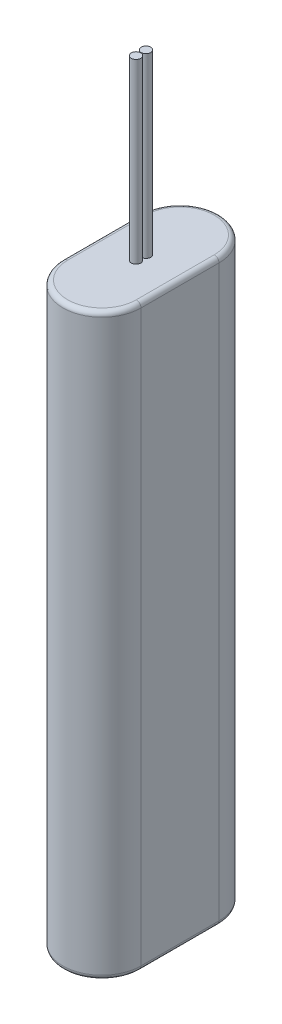
ISO-10303-21;
HEADER;
FILE_DESCRIPTION(('STEP AP214'),'2;1');
FILE_NAME('part.step','',(''),(''),'','','');
FILE_SCHEMA(('AUTOMOTIVE_DESIGN { 1 0 10303 214 1 1 1 1 }'));
ENDSEC;
DATA;
#1=APPLICATION_CONTEXT('core data for automotive mechanical design processes');
#2=APPLICATION_PROTOCOL_DEFINITION('international standard','automotive_design',2000,#1);
#3=PRODUCT_CONTEXT('',#1,'mechanical');
#4=PRODUCT('Part','Part','',(#3));
#5=PRODUCT_RELATED_PRODUCT_CATEGORY('part','',(#4));
#6=PRODUCT_DEFINITION_FORMATION('','',#4);
#7=PRODUCT_DEFINITION_CONTEXT('part definition',#1,'design');
#8=PRODUCT_DEFINITION('design','',#6,#7);
#9=PRODUCT_DEFINITION_SHAPE('','',#8);
#10=(LENGTH_UNIT() NAMED_UNIT(*) SI_UNIT(.MILLI.,.METRE.));
#11=(NAMED_UNIT(*) PLANE_ANGLE_UNIT() SI_UNIT($,.RADIAN.));
#12=(NAMED_UNIT(*) SI_UNIT($,.STERADIAN.) SOLID_ANGLE_UNIT());
#13=UNCERTAINTY_MEASURE_WITH_UNIT(LENGTH_MEASURE(1.E-05),#10,'distance_accuracy_value','');
#14=(GEOMETRIC_REPRESENTATION_CONTEXT(3) GLOBAL_UNCERTAINTY_ASSIGNED_CONTEXT((#13)) GLOBAL_UNIT_ASSIGNED_CONTEXT((#10,
#11,#12)) REPRESENTATION_CONTEXT('',''));
#15=CARTESIAN_POINT('',(0.,0.,0.));
#16=DIRECTION('',(0.,0.,1.));
#17=DIRECTION('',(1.,0.,0.));
#18=AXIS2_PLACEMENT_3D('',#15,#16,#17);
#19=CARTESIAN_POINT('',(16.5,245.,0.));
#20=DIRECTION('',(0.,1.,0.));
#21=DIRECTION('',(0.,0.,1.));
#22=AXIS2_PLACEMENT_3D('',#19,#20,#21);
#23=PLANE('',#22);
#24=CARTESIAN_POINT('',(16.5,245.,-18.6));
#25=DIRECTION('',(0.,1.,0.));
#26=DIRECTION('',(0.,0.,1.));
#27=AXIS2_PLACEMENT_3D('',#24,#25,#26);
#28=CIRCLE('',#27,2.);
#29=CARTESIAN_POINT('',(16.5,245.,-16.6));
#30=VERTEX_POINT('',#29);
#31=EDGE_CURVE('E176',#30,#30,#28,.T.);
#32=ORIENTED_EDGE('',*,*,#31,.F.);
#33=EDGE_LOOP('',(#32));
#34=FACE_BOUND('',#33,.T.);
#35=DIRECTION('',(0.,0.,-1.));
#36=VECTOR('',#35,1.);
#37=CARTESIAN_POINT('',(31.,245.,-33.));
#38=LINE('',#37,#36);
#39=CARTESIAN_POINT('',(31.,245.,0.));
#40=VERTEX_POINT('',#39);
#41=CARTESIAN_POINT('',(31.,245.,-33.));
#42=VERTEX_POINT('',#41);
#43=EDGE_CURVE('E131',#40,#42,#38,.T.);
#44=ORIENTED_EDGE('',*,*,#43,.T.);
#45=CARTESIAN_POINT('',(16.5,245.,-33.));
#46=DIRECTION('',(0.,1.,0.));
#47=DIRECTION('',(0.,0.,1.));
#48=AXIS2_PLACEMENT_3D('',#45,#46,#47);
#49=CIRCLE('',#48,14.5);
#50=CARTESIAN_POINT('',(2.,245.,-33.));
#51=VERTEX_POINT('',#50);
#52=EDGE_CURVE('E11',#42,#51,#49,.T.);
#53=ORIENTED_EDGE('',*,*,#52,.T.);
#54=DIRECTION('',(0.,0.,1.));
#55=VECTOR('',#54,1.);
#56=CARTESIAN_POINT('',(2.,245.,0.));
#57=LINE('',#56,#55);
#58=CARTESIAN_POINT('',(2.,245.,0.));
#59=VERTEX_POINT('',#58);
#60=EDGE_CURVE('E40',#51,#59,#57,.T.);
#61=ORIENTED_EDGE('',*,*,#60,.T.);
#62=CARTESIAN_POINT('',(16.5,245.,0.));
#63=DIRECTION('',(0.,1.,0.));
#64=DIRECTION('',(0.,0.,1.));
#65=AXIS2_PLACEMENT_3D('',#62,#63,#64);
#66=CIRCLE('',#65,14.5);
#67=EDGE_CURVE('E150',#59,#40,#66,.T.);
#68=ORIENTED_EDGE('',*,*,#67,.T.);
#69=EDGE_LOOP('',(#44,#53,#61,#68));
#70=FACE_BOUND('',#69,.T.);
#71=CARTESIAN_POINT('',(16.5,245.,-14.4));
#72=DIRECTION('',(0.,1.,0.));
#73=DIRECTION('',(0.,0.,-1.));
#74=AXIS2_PLACEMENT_3D('',#71,#72,#73);
#75=CIRCLE('',#74,2.);
#76=CARTESIAN_POINT('',(16.5,245.,-16.4));
#77=VERTEX_POINT('',#76);
#78=EDGE_CURVE('E182',#77,#77,#75,.T.);
#79=ORIENTED_EDGE('',*,*,#78,.F.);
#80=EDGE_LOOP('',(#79));
#81=FACE_BOUND('',#80,.T.);
#82=ADVANCED_FACE('F31',(#34,#70,#81),#23,.T.);
#83=CARTESIAN_POINT('',(16.5,245.,0.));
#84=DIRECTION('',(0.,-1.,0.));
#85=DIRECTION('',(0.,0.,-1.));
#86=AXIS2_PLACEMENT_3D('',#83,#84,#85);
#87=CYLINDRICAL_SURFACE('',#86,16.5);
#88=DIRECTION('',(0.,-1.,0.));
#89=VECTOR('',#88,1.);
#90=CARTESIAN_POINT('',(0.,245.,0.));
#91=LINE('',#90,#89);
#92=CARTESIAN_POINT('',(0.,243.,0.));
#93=VERTEX_POINT('',#92);
#94=CARTESIAN_POINT('',(0.,2.,0.));
#95=VERTEX_POINT('',#94);
#96=EDGE_CURVE('E144',#93,#95,#91,.T.);
#97=ORIENTED_EDGE('',*,*,#96,.T.);
#98=CARTESIAN_POINT('',(16.5,2.,0.));
#99=DIRECTION('',(0.,1.,0.));
#100=DIRECTION('',(0.,0.,1.));
#101=AXIS2_PLACEMENT_3D('',#98,#99,#100);
#102=CIRCLE('',#101,16.5);
#103=CARTESIAN_POINT('',(33.,2.,0.));
#104=VERTEX_POINT('',#103);
#105=EDGE_CURVE('E120',#95,#104,#102,.T.);
#106=ORIENTED_EDGE('',*,*,#105,.T.);
#107=DIRECTION('',(0.,-1.,0.));
#108=VECTOR('',#107,1.);
#109=CARTESIAN_POINT('',(33.,245.,0.));
#110=LINE('',#109,#108);
#111=CARTESIAN_POINT('',(33.,243.,0.));
#112=VERTEX_POINT('',#111);
#113=EDGE_CURVE('E102',#112,#104,#110,.T.);
#114=ORIENTED_EDGE('',*,*,#113,.F.);
#115=CARTESIAN_POINT('',(16.5,243.,0.));
#116=DIRECTION('',(0.,1.,0.));
#117=DIRECTION('',(0.,0.,1.));
#118=AXIS2_PLACEMENT_3D('',#115,#116,#117);
#119=CIRCLE('',#118,16.5);
#120=EDGE_CURVE('E117',#112,#93,#119,.F.);
#121=ORIENTED_EDGE('',*,*,#120,.T.);
#122=EDGE_LOOP('',(#97,#106,#114,#121));
#123=FACE_BOUND('',#122,.T.);
#124=ADVANCED_FACE('F116',(#123),#87,.T.);
#125=CARTESIAN_POINT('',(33.,245.,-33.));
#126=DIRECTION('',(-1.,0.,0.));
#127=DIRECTION('',(0.,0.,1.));
#128=AXIS2_PLACEMENT_3D('',#125,#126,#127);
#129=PLANE('',#128);
#130=ORIENTED_EDGE('',*,*,#113,.T.);
#131=DIRECTION('',(0.,0.,-1.));
#132=VECTOR('',#131,1.);
#133=CARTESIAN_POINT('',(33.,2.,-33.));
#134=LINE('',#133,#132);
#135=CARTESIAN_POINT('',(33.,2.,-33.));
#136=VERTEX_POINT('',#135);
#137=EDGE_CURVE('E109',#104,#136,#134,.T.);
#138=ORIENTED_EDGE('',*,*,#137,.T.);
#139=DIRECTION('',(0.,-1.,0.));
#140=VECTOR('',#139,1.);
#141=CARTESIAN_POINT('',(33.,245.,-33.));
#142=LINE('',#141,#140);
#143=CARTESIAN_POINT('',(33.,243.,-33.));
#144=VERTEX_POINT('',#143);
#145=EDGE_CURVE('E104',#144,#136,#142,.T.);
#146=ORIENTED_EDGE('',*,*,#145,.F.);
#147=DIRECTION('',(0.,0.,-1.));
#148=VECTOR('',#147,1.);
#149=CARTESIAN_POINT('',(33.,243.,0.));
#150=LINE('',#149,#148);
#151=EDGE_CURVE('E99',#144,#112,#150,.F.);
#152=ORIENTED_EDGE('',*,*,#151,.T.);
#153=EDGE_LOOP('',(#130,#138,#146,#152));
#154=FACE_BOUND('',#153,.T.);
#155=ADVANCED_FACE('F101',(#154),#129,.F.);
#156=CARTESIAN_POINT('',(16.5,245.,-33.));
#157=DIRECTION('',(0.,-1.,0.));
#158=DIRECTION('',(0.,0.,-1.));
#159=AXIS2_PLACEMENT_3D('',#156,#157,#158);
#160=CYLINDRICAL_SURFACE('',#159,16.5);
#161=ORIENTED_EDGE('',*,*,#145,.T.);
#162=CARTESIAN_POINT('',(16.5,2.,-33.));
#163=DIRECTION('',(0.,1.,0.));
#164=DIRECTION('',(0.,0.,1.));
#165=AXIS2_PLACEMENT_3D('',#162,#163,#164);
#166=CIRCLE('',#165,16.5);
#167=CARTESIAN_POINT('',(0.,2.,-33.));
#168=VERTEX_POINT('',#167);
#169=EDGE_CURVE('E153',#136,#168,#166,.T.);
#170=ORIENTED_EDGE('',*,*,#169,.T.);
#171=DIRECTION('',(0.,-1.,0.));
#172=VECTOR('',#171,1.);
#173=CARTESIAN_POINT('',(0.,245.,-33.));
#174=LINE('',#173,#172);
#175=CARTESIAN_POINT('',(0.,243.,-33.));
#176=VERTEX_POINT('',#175);
#177=EDGE_CURVE('E172',#176,#168,#174,.T.);
#178=ORIENTED_EDGE('',*,*,#177,.F.);
#179=CARTESIAN_POINT('',(16.5,243.,-33.));
#180=DIRECTION('',(0.,1.,0.));
#181=DIRECTION('',(0.,0.,1.));
#182=AXIS2_PLACEMENT_3D('',#179,#180,#181);
#183=CIRCLE('',#182,16.5);
#184=EDGE_CURVE('E155',#176,#144,#183,.F.);
#185=ORIENTED_EDGE('',*,*,#184,.T.);
#186=EDGE_LOOP('',(#161,#170,#178,#185));
#187=FACE_BOUND('',#186,.T.);
#188=ADVANCED_FACE('F217',(#187),#160,.T.);
#189=CARTESIAN_POINT('',(0.,245.,0.));
#190=DIRECTION('',(1.,0.,0.));
#191=DIRECTION('',(0.,0.,-1.));
#192=AXIS2_PLACEMENT_3D('',#189,#190,#191);
#193=PLANE('',#192);
#194=ORIENTED_EDGE('',*,*,#177,.T.);
#195=DIRECTION('',(0.,0.,1.));
#196=VECTOR('',#195,1.);
#197=CARTESIAN_POINT('',(0.,2.,0.));
#198=LINE('',#197,#196);
#199=EDGE_CURVE('E110',#168,#95,#198,.T.);
#200=ORIENTED_EDGE('',*,*,#199,.T.);
#201=ORIENTED_EDGE('',*,*,#96,.F.);
#202=DIRECTION('',(0.,0.,1.));
#203=VECTOR('',#202,1.);
#204=CARTESIAN_POINT('',(0.,243.,-33.));
#205=LINE('',#204,#203);
#206=EDGE_CURVE('E159',#93,#176,#205,.F.);
#207=ORIENTED_EDGE('',*,*,#206,.T.);
#208=EDGE_LOOP('',(#194,#200,#201,#207));
#209=FACE_BOUND('',#208,.T.);
#210=ADVANCED_FACE('F213',(#209),#193,.F.);
#211=CARTESIAN_POINT('',(16.5,0.,0.));
#212=DIRECTION('',(0.,1.,0.));
#213=DIRECTION('',(0.,0.,1.));
#214=AXIS2_PLACEMENT_3D('',#211,#212,#213);
#215=PLANE('',#214);
#216=DIRECTION('',(0.,0.,-1.));
#217=VECTOR('',#216,1.);
#218=CARTESIAN_POINT('',(31.,0.,0.));
#219=LINE('',#218,#217);
#220=CARTESIAN_POINT('',(31.,0.,-33.));
#221=VERTEX_POINT('',#220);
#222=CARTESIAN_POINT('',(31.,0.,0.));
#223=VERTEX_POINT('',#222);
#224=EDGE_CURVE('E166',#221,#223,#219,.F.);
#225=ORIENTED_EDGE('',*,*,#224,.T.);
#226=CARTESIAN_POINT('',(16.5,0.,0.));
#227=DIRECTION('',(0.,1.,0.));
#228=DIRECTION('',(0.,0.,1.));
#229=AXIS2_PLACEMENT_3D('',#226,#227,#228);
#230=CIRCLE('',#229,14.5);
#231=CARTESIAN_POINT('',(2.,0.,0.));
#232=VERTEX_POINT('',#231);
#233=EDGE_CURVE('E161',#223,#232,#230,.F.);
#234=ORIENTED_EDGE('',*,*,#233,.T.);
#235=DIRECTION('',(0.,0.,1.));
#236=VECTOR('',#235,1.);
#237=CARTESIAN_POINT('',(2.,0.,0.));
#238=LINE('',#237,#236);
#239=CARTESIAN_POINT('',(2.,0.,-33.));
#240=VERTEX_POINT('',#239);
#241=EDGE_CURVE('E164',#232,#240,#238,.F.);
#242=ORIENTED_EDGE('',*,*,#241,.T.);
#243=CARTESIAN_POINT('',(16.5,0.,-33.));
#244=DIRECTION('',(0.,1.,0.));
#245=DIRECTION('',(0.,0.,1.));
#246=AXIS2_PLACEMENT_3D('',#243,#244,#245);
#247=CIRCLE('',#246,14.5);
#248=EDGE_CURVE('E168',#240,#221,#247,.F.);
#249=ORIENTED_EDGE('',*,*,#248,.T.);
#250=EDGE_LOOP('',(#225,#234,#242,#249));
#251=FACE_BOUND('',#250,.T.);
#252=ADVANCED_FACE('F209',(#251),#215,.F.);
#253=CARTESIAN_POINT('',(16.5,2.,-33.));
#254=DIRECTION('',(0.,1.,0.));
#255=DIRECTION('',(0.,0.,1.));
#256=AXIS2_PLACEMENT_3D('',#253,#254,#255);
#257=TOROIDAL_SURFACE('',#256,14.5,2.);
#258=CARTESIAN_POINT('',(31.,2.,-33.));
#259=DIRECTION('',(0.,0.,1.));
#260=DIRECTION('',(1.,0.,0.));
#261=AXIS2_PLACEMENT_3D('',#258,#259,#260);
#262=CIRCLE('',#261,2.);
#263=EDGE_CURVE('E145',#221,#136,#262,.T.);
#264=ORIENTED_EDGE('',*,*,#263,.F.);
#265=ORIENTED_EDGE('',*,*,#248,.F.);
#266=CARTESIAN_POINT('',(2.,2.,-33.));
#267=DIRECTION('',(0.,0.,1.));
#268=DIRECTION('',(1.,0.,0.));
#269=AXIS2_PLACEMENT_3D('',#266,#267,#268);
#270=CIRCLE('',#269,2.);
#271=EDGE_CURVE('E141',#168,#240,#270,.T.);
#272=ORIENTED_EDGE('',*,*,#271,.F.);
#273=ORIENTED_EDGE('',*,*,#169,.F.);
#274=EDGE_LOOP('',(#264,#265,#272,#273));
#275=FACE_BOUND('',#274,.T.);
#276=ADVANCED_FACE('F212',(#275),#257,.T.);
#277=CARTESIAN_POINT('',(2.,2.,0.));
#278=DIRECTION('',(0.,0.,1.));
#279=DIRECTION('',(1.,0.,0.));
#280=AXIS2_PLACEMENT_3D('',#277,#278,#279);
#281=CYLINDRICAL_SURFACE('',#280,2.);
#282=ORIENTED_EDGE('',*,*,#271,.T.);
#283=ORIENTED_EDGE('',*,*,#241,.F.);
#284=CARTESIAN_POINT('',(2.,2.,0.));
#285=DIRECTION('',(0.,0.,1.));
#286=DIRECTION('',(1.,0.,0.));
#287=AXIS2_PLACEMENT_3D('',#284,#285,#286);
#288=CIRCLE('',#287,2.);
#289=EDGE_CURVE('E133',#95,#232,#288,.T.);
#290=ORIENTED_EDGE('',*,*,#289,.F.);
#291=ORIENTED_EDGE('',*,*,#199,.F.);
#292=EDGE_LOOP('',(#282,#283,#290,#291));
#293=FACE_BOUND('',#292,.T.);
#294=ADVANCED_FACE('F231',(#293),#281,.T.);
#295=CARTESIAN_POINT('',(31.,2.,-33.));
#296=DIRECTION('',(0.,0.,-1.));
#297=DIRECTION('',(-1.,0.,0.));
#298=AXIS2_PLACEMENT_3D('',#295,#296,#297);
#299=CYLINDRICAL_SURFACE('',#298,2.);
#300=ORIENTED_EDGE('',*,*,#263,.T.);
#301=ORIENTED_EDGE('',*,*,#137,.F.);
#302=CARTESIAN_POINT('',(31.,2.,0.));
#303=DIRECTION('',(0.,0.,1.));
#304=DIRECTION('',(1.,0.,0.));
#305=AXIS2_PLACEMENT_3D('',#302,#303,#304);
#306=CIRCLE('',#305,2.);
#307=EDGE_CURVE('E132',#223,#104,#306,.T.);
#308=ORIENTED_EDGE('',*,*,#307,.F.);
#309=ORIENTED_EDGE('',*,*,#224,.F.);
#310=EDGE_LOOP('',(#300,#301,#308,#309));
#311=FACE_BOUND('',#310,.T.);
#312=ADVANCED_FACE('F227',(#311),#299,.T.);
#313=CARTESIAN_POINT('',(16.5,2.,0.));
#314=DIRECTION('',(0.,1.,0.));
#315=DIRECTION('',(0.,0.,1.));
#316=AXIS2_PLACEMENT_3D('',#313,#314,#315);
#317=TOROIDAL_SURFACE('',#316,14.5,2.);
#318=ORIENTED_EDGE('',*,*,#289,.T.);
#319=ORIENTED_EDGE('',*,*,#233,.F.);
#320=ORIENTED_EDGE('',*,*,#307,.T.);
#321=ORIENTED_EDGE('',*,*,#105,.F.);
#322=EDGE_LOOP('',(#318,#319,#320,#321));
#323=FACE_BOUND('',#322,.T.);
#324=ADVANCED_FACE('F224',(#323),#317,.T.);
#325=CARTESIAN_POINT('',(16.5,243.,0.));
#326=DIRECTION('',(0.,1.,0.));
#327=DIRECTION('',(0.,0.,1.));
#328=AXIS2_PLACEMENT_3D('',#325,#326,#327);
#329=TOROIDAL_SURFACE('',#328,14.5,2.);
#330=CARTESIAN_POINT('',(2.,243.,0.));
#331=DIRECTION('',(0.,0.,-1.));
#332=DIRECTION('',(-1.,0.,0.));
#333=AXIS2_PLACEMENT_3D('',#330,#331,#332);
#334=CIRCLE('',#333,2.);
#335=EDGE_CURVE('E127',#93,#59,#334,.T.);
#336=ORIENTED_EDGE('',*,*,#335,.F.);
#337=ORIENTED_EDGE('',*,*,#120,.F.);
#338=CARTESIAN_POINT('',(31.,243.,0.));
#339=DIRECTION('',(0.,0.,-1.));
#340=DIRECTION('',(-1.,0.,0.));
#341=AXIS2_PLACEMENT_3D('',#338,#339,#340);
#342=CIRCLE('',#341,2.);
#343=EDGE_CURVE('E35',#40,#112,#342,.T.);
#344=ORIENTED_EDGE('',*,*,#343,.F.);
#345=ORIENTED_EDGE('',*,*,#67,.F.);
#346=EDGE_LOOP('',(#336,#337,#344,#345));
#347=FACE_BOUND('',#346,.T.);
#348=ADVANCED_FACE('F33',(#347),#329,.T.);
#349=CARTESIAN_POINT('',(31.,243.,0.));
#350=DIRECTION('',(0.,0.,1.));
#351=DIRECTION('',(1.,0.,0.));
#352=AXIS2_PLACEMENT_3D('',#349,#350,#351);
#353=CYLINDRICAL_SURFACE('',#352,2.);
#354=ORIENTED_EDGE('',*,*,#343,.T.);
#355=ORIENTED_EDGE('',*,*,#151,.F.);
#356=CARTESIAN_POINT('',(31.,243.,-33.));
#357=DIRECTION('',(0.,0.,-1.));
#358=DIRECTION('',(-1.,0.,0.));
#359=AXIS2_PLACEMENT_3D('',#356,#357,#358);
#360=CIRCLE('',#359,2.);
#361=EDGE_CURVE('E135',#42,#144,#360,.T.);
#362=ORIENTED_EDGE('',*,*,#361,.F.);
#363=ORIENTED_EDGE('',*,*,#43,.F.);
#364=EDGE_LOOP('',(#354,#355,#362,#363));
#365=FACE_BOUND('',#364,.T.);
#366=ADVANCED_FACE('F130',(#365),#353,.T.);
#367=CARTESIAN_POINT('',(2.,243.,0.));
#368=DIRECTION('',(0.,0.,-1.));
#369=DIRECTION('',(-1.,0.,0.));
#370=AXIS2_PLACEMENT_3D('',#367,#368,#369);
#371=CYLINDRICAL_SURFACE('',#370,2.);
#372=ORIENTED_EDGE('',*,*,#335,.T.);
#373=ORIENTED_EDGE('',*,*,#60,.F.);
#374=CARTESIAN_POINT('',(2.,243.,-33.));
#375=DIRECTION('',(0.,0.,-1.));
#376=DIRECTION('',(-1.,0.,0.));
#377=AXIS2_PLACEMENT_3D('',#374,#375,#376);
#378=CIRCLE('',#377,2.);
#379=EDGE_CURVE('E48',#176,#51,#378,.T.);
#380=ORIENTED_EDGE('',*,*,#379,.F.);
#381=ORIENTED_EDGE('',*,*,#206,.F.);
#382=EDGE_LOOP('',(#372,#373,#380,#381));
#383=FACE_BOUND('',#382,.T.);
#384=ADVANCED_FACE('F242',(#383),#371,.T.);
#385=CARTESIAN_POINT('',(16.5,243.,-33.));
#386=DIRECTION('',(0.,1.,0.));
#387=DIRECTION('',(0.,0.,1.));
#388=AXIS2_PLACEMENT_3D('',#385,#386,#387);
#389=TOROIDAL_SURFACE('',#388,14.5,2.);
#390=ORIENTED_EDGE('',*,*,#361,.T.);
#391=ORIENTED_EDGE('',*,*,#184,.F.);
#392=ORIENTED_EDGE('',*,*,#379,.T.);
#393=ORIENTED_EDGE('',*,*,#52,.F.);
#394=EDGE_LOOP('',(#390,#391,#392,#393));
#395=FACE_BOUND('',#394,.T.);
#396=ADVANCED_FACE('F239',(#395),#389,.T.);
#397=CARTESIAN_POINT('',(16.5,320.,-18.6));
#398=DIRECTION('',(0.,-1.,0.));
#399=DIRECTION('',(0.,0.,-1.));
#400=AXIS2_PLACEMENT_3D('',#397,#398,#399);
#401=CYLINDRICAL_SURFACE('',#400,2.);
#402=CARTESIAN_POINT('',(16.5,320.,-18.6));
#403=DIRECTION('',(0.,1.,0.));
#404=DIRECTION('',(0.,0.,1.));
#405=AXIS2_PLACEMENT_3D('',#402,#403,#404);
#406=CIRCLE('',#405,2.);
#407=CARTESIAN_POINT('',(16.5,320.,-16.6));
#408=VERTEX_POINT('',#407);
#409=EDGE_CURVE('E140',#408,#408,#406,.T.);
#410=ORIENTED_EDGE('',*,*,#409,.F.);
#411=EDGE_LOOP('',(#410));
#412=FACE_BOUND('',#411,.T.);
#413=ORIENTED_EDGE('',*,*,#31,.T.);
#414=EDGE_LOOP('',(#413));
#415=FACE_BOUND('',#414,.T.);
#416=ADVANCED_FACE('F207',(#412,#415),#401,.T.);
#417=CARTESIAN_POINT('',(16.5,320.,-18.6));
#418=DIRECTION('',(0.,1.,0.));
#419=DIRECTION('',(0.,0.,1.));
#420=AXIS2_PLACEMENT_3D('',#417,#418,#419);
#421=PLANE('',#420);
#422=ORIENTED_EDGE('',*,*,#409,.T.);
#423=EDGE_LOOP('',(#422));
#424=FACE_BOUND('',#423,.T.);
#425=ADVANCED_FACE('F193',(#424),#421,.T.);
#426=CARTESIAN_POINT('',(16.5,320.,-14.4));
#427=DIRECTION('',(0.,-1.,0.));
#428=DIRECTION('',(0.,0.,-1.));
#429=AXIS2_PLACEMENT_3D('',#426,#427,#428);
#430=CYLINDRICAL_SURFACE('',#429,2.);
#431=CARTESIAN_POINT('',(16.5,320.,-14.4));
#432=DIRECTION('',(0.,1.,0.));
#433=DIRECTION('',(0.,0.,-1.));
#434=AXIS2_PLACEMENT_3D('',#431,#432,#433);
#435=CIRCLE('',#434,2.);
#436=CARTESIAN_POINT('',(16.5,320.,-16.4));
#437=VERTEX_POINT('',#436);
#438=EDGE_CURVE('E179',#437,#437,#435,.T.);
#439=ORIENTED_EDGE('',*,*,#438,.F.);
#440=EDGE_LOOP('',(#439));
#441=FACE_BOUND('',#440,.T.);
#442=ORIENTED_EDGE('',*,*,#78,.T.);
#443=EDGE_LOOP('',(#442));
#444=FACE_BOUND('',#443,.T.);
#445=ADVANCED_FACE('F190',(#441,#444),#430,.T.);
#446=CARTESIAN_POINT('',(16.5,320.,-14.4));
#447=DIRECTION('',(0.,-1.,0.));
#448=DIRECTION('',(0.,0.,-1.));
#449=AXIS2_PLACEMENT_3D('',#446,#447,#448);
#450=PLANE('',#449);
#451=ORIENTED_EDGE('',*,*,#438,.T.);
#452=EDGE_LOOP('',(#451));
#453=FACE_BOUND('',#452,.T.);
#454=ADVANCED_FACE('F188',(#453),#450,.F.);
#455=CLOSED_SHELL('',(#82,#124,#155,#188,#210,#252,#276,#294,#312,#324,#348,#366,#384,#396,#416,
#425,#445,#454));
#456=MANIFOLD_SOLID_BREP('B2',#455);
#457=ADVANCED_BREP_SHAPE_REPRESENTATION('',(#18,#456),#14);
#458=SHAPE_DEFINITION_REPRESENTATION(#9,#457);
ENDSEC;
END-ISO-10303-21;
